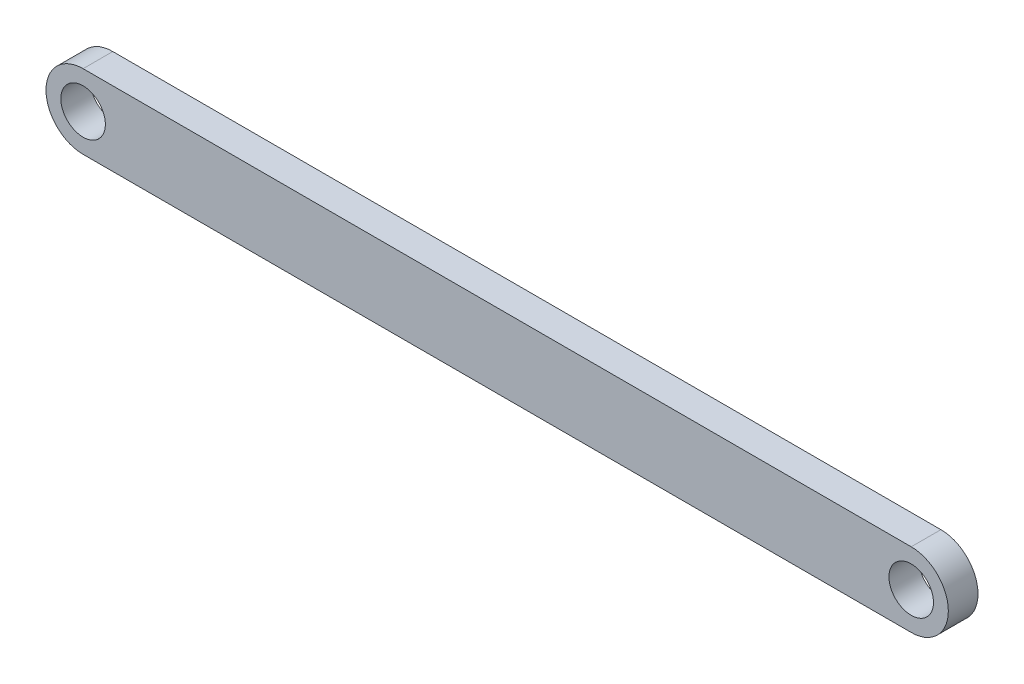
ISO-10303-21;
HEADER;
FILE_DESCRIPTION(('STEP AP214'),'2;1');
FILE_NAME('part.step','',(''),(''),'','','');
FILE_SCHEMA(('AUTOMOTIVE_DESIGN { 1 0 10303 214 1 1 1 1 }'));
ENDSEC;
DATA;
#1=APPLICATION_CONTEXT('core data for automotive mechanical design processes');
#2=APPLICATION_PROTOCOL_DEFINITION('international standard','automotive_design',2000,#1);
#3=PRODUCT_CONTEXT('',#1,'mechanical');
#4=PRODUCT('Part','Part','',(#3));
#5=PRODUCT_RELATED_PRODUCT_CATEGORY('part','',(#4));
#6=PRODUCT_DEFINITION_FORMATION('','',#4);
#7=PRODUCT_DEFINITION_CONTEXT('part definition',#1,'design');
#8=PRODUCT_DEFINITION('design','',#6,#7);
#9=PRODUCT_DEFINITION_SHAPE('','',#8);
#10=(LENGTH_UNIT() NAMED_UNIT(*) SI_UNIT(.MILLI.,.METRE.));
#11=(NAMED_UNIT(*) PLANE_ANGLE_UNIT() SI_UNIT($,.RADIAN.));
#12=(NAMED_UNIT(*) SI_UNIT($,.STERADIAN.) SOLID_ANGLE_UNIT());
#13=UNCERTAINTY_MEASURE_WITH_UNIT(LENGTH_MEASURE(1.E-05),#10,'distance_accuracy_value','');
#14=(GEOMETRIC_REPRESENTATION_CONTEXT(3) GLOBAL_UNCERTAINTY_ASSIGNED_CONTEXT((#13)) GLOBAL_UNIT_ASSIGNED_CONTEXT((#10,
#11,#12)) REPRESENTATION_CONTEXT('',''));
#15=CARTESIAN_POINT('',(0.,0.,0.));
#16=DIRECTION('',(0.,0.,1.));
#17=DIRECTION('',(1.,0.,0.));
#18=AXIS2_PLACEMENT_3D('',#15,#16,#17);
#19=CARTESIAN_POINT('',(0.0586249223835936,0.0193835916528812,2.));
#20=DIRECTION('',(0.,0.,1.));
#21=DIRECTION('',(1.,0.,0.));
#22=AXIS2_PLACEMENT_3D('',#19,#20,#21);
#23=PLANE('',#22);
#24=CARTESIAN_POINT('',(0.0586249223835936,0.0193835916528812,2.));
#25=DIRECTION('',(0.,0.,1.));
#26=DIRECTION('',(1.,0.,0.));
#27=AXIS2_PLACEMENT_3D('',#24,#25,#26);
#28=CIRCLE('',#27,1.5);
#29=CARTESIAN_POINT('',(1.55862492238359,0.0193835916528812,2.));
#30=VERTEX_POINT('',#29);
#31=EDGE_CURVE('E99',#30,#30,#28,.T.);
#32=ORIENTED_EDGE('',*,*,#31,.F.);
#33=EDGE_LOOP('',(#32));
#34=FACE_BOUND('',#33,.T.);
#35=CARTESIAN_POINT('',(0.0586249223835936,0.0193835916528812,2.));
#36=DIRECTION('',(0.,0.,1.));
#37=DIRECTION('',(1.,0.,0.));
#38=AXIS2_PLACEMENT_3D('',#35,#36,#37);
#39=CIRCLE('',#38,2.5);
#40=CARTESIAN_POINT('',(0.0586249223835936,2.51938359165288,2.));
#41=VERTEX_POINT('',#40);
#42=CARTESIAN_POINT('',(0.0586249223835936,-2.48061640834712,2.));
#43=VERTEX_POINT('',#42);
#44=EDGE_CURVE('E84',#41,#43,#39,.T.);
#45=ORIENTED_EDGE('',*,*,#44,.T.);
#46=DIRECTION('',(1.,0.,0.));
#47=VECTOR('',#46,1.);
#48=CARTESIAN_POINT('',(0.0586249223835936,-2.48061640834712,2.));
#49=LINE('',#48,#47);
#50=CARTESIAN_POINT('',(55.8586249223836,-2.48061640834712,2.));
#51=VERTEX_POINT('',#50);
#52=EDGE_CURVE('E79',#43,#51,#49,.T.);
#53=ORIENTED_EDGE('',*,*,#52,.T.);
#54=CARTESIAN_POINT('',(55.8586249223836,0.0193835916528812,2.));
#55=DIRECTION('',(0.,0.,1.));
#56=DIRECTION('',(1.,0.,0.));
#57=AXIS2_PLACEMENT_3D('',#54,#55,#56);
#58=CIRCLE('',#57,2.5);
#59=CARTESIAN_POINT('',(55.8586249223836,2.51938359165288,2.));
#60=VERTEX_POINT('',#59);
#61=EDGE_CURVE('E82',#51,#60,#58,.T.);
#62=ORIENTED_EDGE('',*,*,#61,.T.);
#63=DIRECTION('',(-1.,0.,0.));
#64=VECTOR('',#63,1.);
#65=CARTESIAN_POINT('',(0.0586249223835936,2.51938359165288,2.));
#66=LINE('',#65,#64);
#67=EDGE_CURVE('E49',#60,#41,#66,.T.);
#68=ORIENTED_EDGE('',*,*,#67,.T.);
#69=EDGE_LOOP('',(#45,#53,#62,#68));
#70=FACE_BOUND('',#69,.T.);
#71=CARTESIAN_POINT('',(55.8586249223836,0.0193835916528812,2.));
#72=DIRECTION('',(0.,0.,1.));
#73=DIRECTION('',(1.,0.,0.));
#74=AXIS2_PLACEMENT_3D('',#71,#72,#73);
#75=CIRCLE('',#74,1.5);
#76=CARTESIAN_POINT('',(57.3586249223836,0.0193835916528812,2.));
#77=VERTEX_POINT('',#76);
#78=EDGE_CURVE('E114',#77,#77,#75,.T.);
#79=ORIENTED_EDGE('',*,*,#78,.F.);
#80=EDGE_LOOP('',(#79));
#81=FACE_BOUND('',#80,.T.);
#82=ADVANCED_FACE('F32',(#34,#70,#81),#23,.T.);
#83=CARTESIAN_POINT('',(0.0586249223835936,0.0193835916528812,0.));
#84=DIRECTION('',(0.,0.,1.));
#85=DIRECTION('',(1.,0.,0.));
#86=AXIS2_PLACEMENT_3D('',#83,#84,#85);
#87=PLANE('',#86);
#88=CARTESIAN_POINT('',(0.0586249223835936,0.0193835916528812,0.));
#89=DIRECTION('',(0.,0.,1.));
#90=DIRECTION('',(1.,0.,0.));
#91=AXIS2_PLACEMENT_3D('',#88,#89,#90);
#92=CIRCLE('',#91,2.5);
#93=CARTESIAN_POINT('',(0.0586249223835936,2.51938359165288,0.));
#94=VERTEX_POINT('',#93);
#95=CARTESIAN_POINT('',(0.0586249223835936,-2.48061640834712,0.));
#96=VERTEX_POINT('',#95);
#97=EDGE_CURVE('E96',#94,#96,#92,.T.);
#98=ORIENTED_EDGE('',*,*,#97,.F.);
#99=DIRECTION('',(-1.,0.,0.));
#100=VECTOR('',#99,1.);
#101=CARTESIAN_POINT('',(0.0586249223835936,2.51938359165288,0.));
#102=LINE('',#101,#100);
#103=CARTESIAN_POINT('',(55.8586249223836,2.51938359165288,0.));
#104=VERTEX_POINT('',#103);
#105=EDGE_CURVE('E72',#104,#94,#102,.T.);
#106=ORIENTED_EDGE('',*,*,#105,.F.);
#107=CARTESIAN_POINT('',(55.8586249223836,0.0193835916528812,0.));
#108=DIRECTION('',(0.,0.,1.));
#109=DIRECTION('',(1.,0.,0.));
#110=AXIS2_PLACEMENT_3D('',#107,#108,#109);
#111=CIRCLE('',#110,2.5);
#112=CARTESIAN_POINT('',(55.8586249223836,-2.48061640834712,0.));
#113=VERTEX_POINT('',#112);
#114=EDGE_CURVE('E66',#113,#104,#111,.T.);
#115=ORIENTED_EDGE('',*,*,#114,.F.);
#116=DIRECTION('',(1.,0.,0.));
#117=VECTOR('',#116,1.);
#118=CARTESIAN_POINT('',(0.0586249223835936,-2.48061640834712,0.));
#119=LINE('',#118,#117);
#120=EDGE_CURVE('E88',#96,#113,#119,.T.);
#121=ORIENTED_EDGE('',*,*,#120,.F.);
#122=EDGE_LOOP('',(#98,#106,#115,#121));
#123=FACE_BOUND('',#122,.T.);
#124=CARTESIAN_POINT('',(0.0586249223835936,0.0193835916528812,0.));
#125=DIRECTION('',(0.,0.,1.));
#126=DIRECTION('',(1.,0.,0.));
#127=AXIS2_PLACEMENT_3D('',#124,#125,#126);
#128=CIRCLE('',#127,1.5);
#129=CARTESIAN_POINT('',(1.55862492238359,0.0193835916528812,0.));
#130=VERTEX_POINT('',#129);
#131=EDGE_CURVE('E111',#130,#130,#128,.T.);
#132=ORIENTED_EDGE('',*,*,#131,.T.);
#133=EDGE_LOOP('',(#132));
#134=FACE_BOUND('',#133,.T.);
#135=CARTESIAN_POINT('',(55.8586249223836,0.0193835916528812,0.));
#136=DIRECTION('',(0.,0.,1.));
#137=DIRECTION('',(1.,0.,0.));
#138=AXIS2_PLACEMENT_3D('',#135,#136,#137);
#139=CIRCLE('',#138,1.5);
#140=CARTESIAN_POINT('',(57.3586249223836,0.0193835916528812,0.));
#141=VERTEX_POINT('',#140);
#142=EDGE_CURVE('E117',#141,#141,#139,.T.);
#143=ORIENTED_EDGE('',*,*,#142,.T.);
#144=EDGE_LOOP('',(#143));
#145=FACE_BOUND('',#144,.T.);
#146=ADVANCED_FACE('F107',(#123,#134,#145),#87,.F.);
#147=CARTESIAN_POINT('',(0.0586249223835936,0.0193835916528812,2.));
#148=DIRECTION('',(0.,0.,-1.));
#149=DIRECTION('',(-1.,0.,0.));
#150=AXIS2_PLACEMENT_3D('',#147,#148,#149);
#151=CYLINDRICAL_SURFACE('',#150,2.5);
#152=ORIENTED_EDGE('',*,*,#97,.T.);
#153=DIRECTION('',(0.,0.,-1.));
#154=VECTOR('',#153,1.);
#155=CARTESIAN_POINT('',(0.0586249223835936,-2.48061640834712,2.));
#156=LINE('',#155,#154);
#157=EDGE_CURVE('E11',#43,#96,#156,.T.);
#158=ORIENTED_EDGE('',*,*,#157,.F.);
#159=ORIENTED_EDGE('',*,*,#44,.F.);
#160=DIRECTION('',(0.,0.,-1.));
#161=VECTOR('',#160,1.);
#162=CARTESIAN_POINT('',(0.0586249223835936,2.51938359165288,2.));
#163=LINE('',#162,#161);
#164=EDGE_CURVE('E92',#41,#94,#163,.T.);
#165=ORIENTED_EDGE('',*,*,#164,.T.);
#166=EDGE_LOOP('',(#152,#158,#159,#165));
#167=FACE_BOUND('',#166,.T.);
#168=ADVANCED_FACE('F34',(#167),#151,.T.);
#169=CARTESIAN_POINT('',(0.0586249223835936,-2.48061640834712,2.));
#170=DIRECTION('',(0.,1.,0.));
#171=DIRECTION('',(0.,0.,1.));
#172=AXIS2_PLACEMENT_3D('',#169,#170,#171);
#173=PLANE('',#172);
#174=ORIENTED_EDGE('',*,*,#120,.T.);
#175=DIRECTION('',(0.,0.,-1.));
#176=VECTOR('',#175,1.);
#177=CARTESIAN_POINT('',(55.8586249223836,-2.48061640834712,2.));
#178=LINE('',#177,#176);
#179=EDGE_CURVE('E41',#51,#113,#178,.T.);
#180=ORIENTED_EDGE('',*,*,#179,.F.);
#181=ORIENTED_EDGE('',*,*,#52,.F.);
#182=ORIENTED_EDGE('',*,*,#157,.T.);
#183=EDGE_LOOP('',(#174,#180,#181,#182));
#184=FACE_BOUND('',#183,.T.);
#185=ADVANCED_FACE('F87',(#184),#173,.F.);
#186=CARTESIAN_POINT('',(55.8586249223836,0.0193835916528812,2.));
#187=DIRECTION('',(0.,0.,-1.));
#188=DIRECTION('',(-1.,0.,0.));
#189=AXIS2_PLACEMENT_3D('',#186,#187,#188);
#190=CYLINDRICAL_SURFACE('',#189,2.5);
#191=ORIENTED_EDGE('',*,*,#114,.T.);
#192=DIRECTION('',(0.,0.,-1.));
#193=VECTOR('',#192,1.);
#194=CARTESIAN_POINT('',(55.8586249223836,2.51938359165288,2.));
#195=LINE('',#194,#193);
#196=EDGE_CURVE('E89',#60,#104,#195,.T.);
#197=ORIENTED_EDGE('',*,*,#196,.F.);
#198=ORIENTED_EDGE('',*,*,#61,.F.);
#199=ORIENTED_EDGE('',*,*,#179,.T.);
#200=EDGE_LOOP('',(#191,#197,#198,#199));
#201=FACE_BOUND('',#200,.T.);
#202=ADVANCED_FACE('F90',(#201),#190,.T.);
#203=CARTESIAN_POINT('',(0.0586249223835936,2.51938359165288,2.));
#204=DIRECTION('',(0.,-1.,0.));
#205=DIRECTION('',(0.,0.,-1.));
#206=AXIS2_PLACEMENT_3D('',#203,#204,#205);
#207=PLANE('',#206);
#208=ORIENTED_EDGE('',*,*,#105,.T.);
#209=ORIENTED_EDGE('',*,*,#164,.F.);
#210=ORIENTED_EDGE('',*,*,#67,.F.);
#211=ORIENTED_EDGE('',*,*,#196,.T.);
#212=EDGE_LOOP('',(#208,#209,#210,#211));
#213=FACE_BOUND('',#212,.T.);
#214=ADVANCED_FACE('F104',(#213),#207,.F.);
#215=CARTESIAN_POINT('',(0.0586249223835936,0.0193835916528812,2.));
#216=DIRECTION('',(0.,0.,-1.));
#217=DIRECTION('',(-1.,0.,0.));
#218=AXIS2_PLACEMENT_3D('',#215,#216,#217);
#219=CYLINDRICAL_SURFACE('',#218,1.5);
#220=ORIENTED_EDGE('',*,*,#31,.T.);
#221=EDGE_LOOP('',(#220));
#222=FACE_BOUND('',#221,.T.);
#223=ORIENTED_EDGE('',*,*,#131,.F.);
#224=EDGE_LOOP('',(#223));
#225=FACE_BOUND('',#224,.T.);
#226=ADVANCED_FACE('F134',(#222,#225),#219,.F.);
#227=CARTESIAN_POINT('',(55.8586249223836,0.0193835916528812,2.));
#228=DIRECTION('',(0.,0.,-1.));
#229=DIRECTION('',(-1.,0.,0.));
#230=AXIS2_PLACEMENT_3D('',#227,#228,#229);
#231=CYLINDRICAL_SURFACE('',#230,1.5);
#232=ORIENTED_EDGE('',*,*,#78,.T.);
#233=EDGE_LOOP('',(#232));
#234=FACE_BOUND('',#233,.T.);
#235=ORIENTED_EDGE('',*,*,#142,.F.);
#236=EDGE_LOOP('',(#235));
#237=FACE_BOUND('',#236,.T.);
#238=ADVANCED_FACE('F123',(#234,#237),#231,.F.);
#239=CLOSED_SHELL('',(#82,#146,#168,#185,#202,#214,#226,#238));
#240=MANIFOLD_SOLID_BREP('B2',#239);
#241=ADVANCED_BREP_SHAPE_REPRESENTATION('',(#18,#240),#14);
#242=SHAPE_DEFINITION_REPRESENTATION(#9,#241);
ENDSEC;
END-ISO-10303-21;
